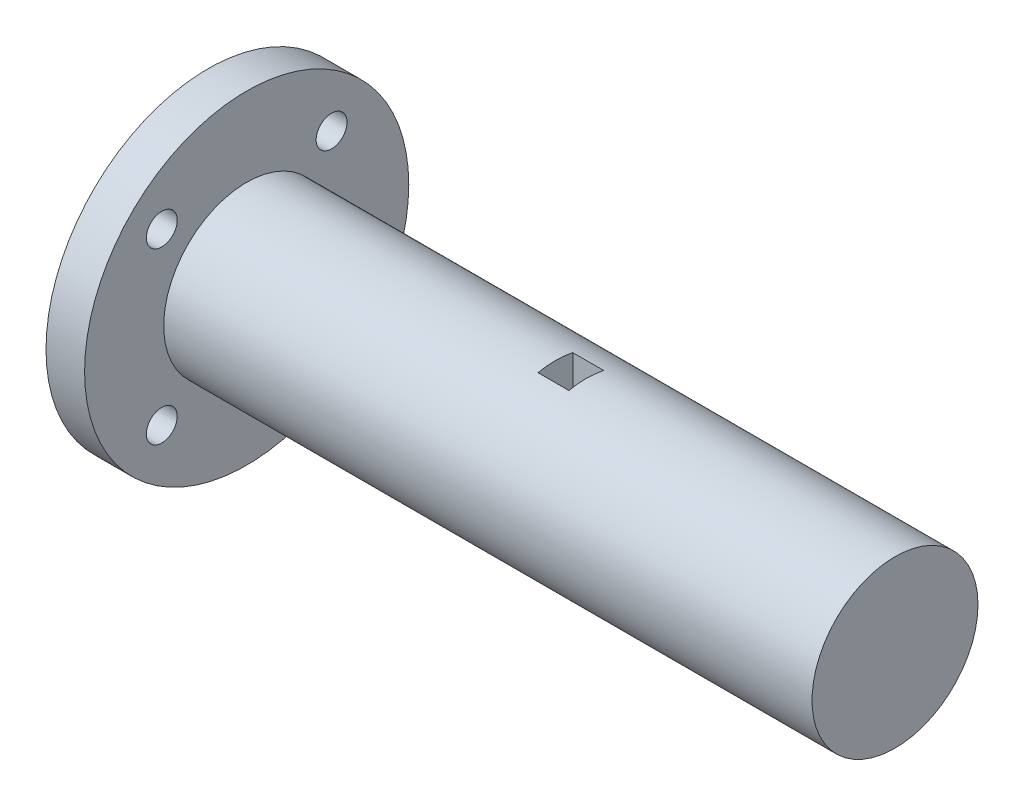
ISO-10303-21;
HEADER;
FILE_DESCRIPTION(('STEP AP214'),'2;1');
FILE_NAME('part.step','',(''),(''),'','','');
FILE_SCHEMA(('AUTOMOTIVE_DESIGN { 1 0 10303 214 1 1 1 1 }'));
ENDSEC;
DATA;
#1=APPLICATION_CONTEXT('core data for automotive mechanical design processes');
#2=APPLICATION_PROTOCOL_DEFINITION('international standard','automotive_design',2000,#1);
#3=PRODUCT_CONTEXT('',#1,'mechanical');
#4=PRODUCT('Part','Part','',(#3));
#5=PRODUCT_RELATED_PRODUCT_CATEGORY('part','',(#4));
#6=PRODUCT_DEFINITION_FORMATION('','',#4);
#7=PRODUCT_DEFINITION_CONTEXT('part definition',#1,'design');
#8=PRODUCT_DEFINITION('design','',#6,#7);
#9=PRODUCT_DEFINITION_SHAPE('','',#8);
#10=(LENGTH_UNIT() NAMED_UNIT(*) SI_UNIT(.MILLI.,.METRE.));
#11=(NAMED_UNIT(*) PLANE_ANGLE_UNIT() SI_UNIT($,.RADIAN.));
#12=(NAMED_UNIT(*) SI_UNIT($,.STERADIAN.) SOLID_ANGLE_UNIT());
#13=UNCERTAINTY_MEASURE_WITH_UNIT(LENGTH_MEASURE(1.E-05),#10,'distance_accuracy_value','');
#14=(GEOMETRIC_REPRESENTATION_CONTEXT(3) GLOBAL_UNCERTAINTY_ASSIGNED_CONTEXT((#13)) GLOBAL_UNIT_ASSIGNED_CONTEXT((#10,
#11,#12)) REPRESENTATION_CONTEXT('',''));
#15=CARTESIAN_POINT('',(0.,0.,0.));
#16=DIRECTION('',(0.,0.,1.));
#17=DIRECTION('',(1.,0.,0.));
#18=AXIS2_PLACEMENT_3D('',#15,#16,#17);
#19=CARTESIAN_POINT('',(40.,0.,0.));
#20=DIRECTION('',(-1.,0.,0.));
#21=DIRECTION('',(0.,0.,1.));
#22=AXIS2_PLACEMENT_3D('',#19,#20,#21);
#23=CYLINDRICAL_SURFACE('',#22,10.75);
#24=CARTESIAN_POINT('',(40.,0.,0.));
#25=DIRECTION('',(1.,0.,0.));
#26=DIRECTION('',(0.,0.,-1.));
#27=AXIS2_PLACEMENT_3D('',#24,#25,#26);
#28=CIRCLE('',#27,10.75);
#29=CARTESIAN_POINT('',(40.,10.5118980208143,-2.25));
#30=VERTEX_POINT('',#29);
#31=CARTESIAN_POINT('',(40.,10.5118980208143,2.25));
#32=VERTEX_POINT('',#31);
#33=EDGE_CURVE('E11',#30,#32,#28,.T.);
#34=ORIENTED_EDGE('',*,*,#33,.F.);
#35=DIRECTION('',(-1.,0.,0.));
#36=VECTOR('',#35,1.);
#37=CARTESIAN_POINT('',(44.,10.5118980208143,-2.25));
#38=LINE('',#37,#36);
#39=CARTESIAN_POINT('',(44.,10.5118980208143,-2.25));
#40=VERTEX_POINT('',#39);
#41=EDGE_CURVE('E101',#40,#30,#38,.T.);
#42=ORIENTED_EDGE('',*,*,#41,.F.);
#43=CARTESIAN_POINT('',(44.,0.,0.));
#44=DIRECTION('',(1.,0.,0.));
#45=DIRECTION('',(0.,0.,-1.));
#46=AXIS2_PLACEMENT_3D('',#43,#44,#45);
#47=CIRCLE('',#46,10.75);
#48=CARTESIAN_POINT('',(44.,10.5118980208143,2.25));
#49=VERTEX_POINT('',#48);
#50=EDGE_CURVE('E179',#40,#49,#47,.T.);
#51=ORIENTED_EDGE('',*,*,#50,.T.);
#52=DIRECTION('',(-1.,0.,0.));
#53=VECTOR('',#52,1.);
#54=CARTESIAN_POINT('',(44.,10.5118980208143,2.25));
#55=LINE('',#54,#53);
#56=EDGE_CURVE('E73',#49,#32,#55,.T.);
#57=ORIENTED_EDGE('',*,*,#56,.T.);
#58=EDGE_LOOP('',(#34,#42,#51,#57));
#59=FACE_BOUND('',#58,.T.);
#60=CARTESIAN_POINT('',(0.,0.,0.));
#61=DIRECTION('',(1.,0.,0.));
#62=DIRECTION('',(0.,0.,-1.));
#63=AXIS2_PLACEMENT_3D('',#60,#61,#62);
#64=CIRCLE('',#63,10.75);
#65=CARTESIAN_POINT('',(0.,0.,-10.75));
#66=VERTEX_POINT('',#65);
#67=EDGE_CURVE('E35',#66,#66,#64,.T.);
#68=ORIENTED_EDGE('',*,*,#67,.T.);
#69=EDGE_LOOP('',(#68));
#70=FACE_BOUND('',#69,.T.);
#71=CARTESIAN_POINT('',(84.,0.,0.));
#72=DIRECTION('',(1.,0.,0.));
#73=DIRECTION('',(0.,0.,-1.));
#74=AXIS2_PLACEMENT_3D('',#71,#72,#73);
#75=CIRCLE('',#74,10.75);
#76=CARTESIAN_POINT('',(84.,0.,-10.75));
#77=VERTEX_POINT('',#76);
#78=EDGE_CURVE('E96',#77,#77,#75,.T.);
#79=ORIENTED_EDGE('',*,*,#78,.F.);
#80=EDGE_LOOP('',(#79));
#81=FACE_BOUND('',#80,.T.);
#82=ADVANCED_FACE('F32',(#59,#70,#81),#23,.T.);
#83=CARTESIAN_POINT('',(40.,0.,0.));
#84=DIRECTION('',(1.,0.,0.));
#85=DIRECTION('',(0.,0.,-1.));
#86=AXIS2_PLACEMENT_3D('',#83,#84,#85);
#87=PLANE('',#86);
#88=DIRECTION('',(0.,1.,0.));
#89=VECTOR('',#88,1.);
#90=CARTESIAN_POINT('',(40.,6.51189802081432,2.25));
#91=LINE('',#90,#89);
#92=CARTESIAN_POINT('',(40.,6.51189802081432,2.25));
#93=VERTEX_POINT('',#92);
#94=EDGE_CURVE('E45',#93,#32,#91,.T.);
#95=ORIENTED_EDGE('',*,*,#94,.F.);
#96=DIRECTION('',(0.,0.,1.));
#97=VECTOR('',#96,1.);
#98=CARTESIAN_POINT('',(40.,6.51189802081432,2.25));
#99=LINE('',#98,#97);
#100=CARTESIAN_POINT('',(40.,6.51189802081432,-2.25));
#101=VERTEX_POINT('',#100);
#102=EDGE_CURVE('E79',#101,#93,#99,.T.);
#103=ORIENTED_EDGE('',*,*,#102,.F.);
#104=DIRECTION('',(0.,-1.,0.));
#105=VECTOR('',#104,1.);
#106=CARTESIAN_POINT('',(40.,6.51189802081432,-2.25));
#107=LINE('',#106,#105);
#108=EDGE_CURVE('E95',#30,#101,#107,.T.);
#109=ORIENTED_EDGE('',*,*,#108,.F.);
#110=ORIENTED_EDGE('',*,*,#33,.T.);
#111=EDGE_LOOP('',(#95,#103,#109,#110));
#112=FACE_BOUND('',#111,.T.);
#113=ADVANCED_FACE('F167',(#112),#87,.T.);
#114=CARTESIAN_POINT('',(-5.,0.,0.));
#115=DIRECTION('',(-1.,0.,0.));
#116=DIRECTION('',(0.,0.,1.));
#117=AXIS2_PLACEMENT_3D('',#114,#115,#116);
#118=PLANE('',#117);
#119=CARTESIAN_POINT('',(-5.,-11.,11.));
#120=DIRECTION('',(-1.,0.,0.));
#121=DIRECTION('',(0.,0.,1.));
#122=AXIS2_PLACEMENT_3D('',#119,#120,#121);
#123=CIRCLE('',#122,2.);
#124=CARTESIAN_POINT('',(-5.,-11.,13.));
#125=VERTEX_POINT('',#124);
#126=EDGE_CURVE('E112',#125,#125,#123,.T.);
#127=ORIENTED_EDGE('',*,*,#126,.F.);
#128=EDGE_LOOP('',(#127));
#129=FACE_BOUND('',#128,.T.);
#130=CARTESIAN_POINT('',(-5.,11.,-11.));
#131=DIRECTION('',(-1.,0.,0.));
#132=DIRECTION('',(0.,0.,1.));
#133=AXIS2_PLACEMENT_3D('',#130,#131,#132);
#134=CIRCLE('',#133,2.);
#135=CARTESIAN_POINT('',(-5.,11.,-9.));
#136=VERTEX_POINT('',#135);
#137=EDGE_CURVE('E124',#136,#136,#134,.T.);
#138=ORIENTED_EDGE('',*,*,#137,.F.);
#139=EDGE_LOOP('',(#138));
#140=FACE_BOUND('',#139,.T.);
#141=CARTESIAN_POINT('',(-5.,0.,0.));
#142=DIRECTION('',(-1.,0.,0.));
#143=DIRECTION('',(0.,0.,1.));
#144=AXIS2_PLACEMENT_3D('',#141,#142,#143);
#145=CIRCLE('',#144,21.);
#146=CARTESIAN_POINT('',(-5.,0.,21.));
#147=VERTEX_POINT('',#146);
#148=EDGE_CURVE('E130',#147,#147,#145,.T.);
#149=ORIENTED_EDGE('',*,*,#148,.T.);
#150=EDGE_LOOP('',(#149));
#151=FACE_BOUND('',#150,.T.);
#152=CARTESIAN_POINT('',(-5.,11.,11.));
#153=DIRECTION('',(-1.,0.,0.));
#154=DIRECTION('',(0.,0.,-1.));
#155=AXIS2_PLACEMENT_3D('',#152,#153,#154);
#156=CIRCLE('',#155,2.);
#157=CARTESIAN_POINT('',(-5.,11.,9.));
#158=VERTEX_POINT('',#157);
#159=EDGE_CURVE('E118',#158,#158,#156,.T.);
#160=ORIENTED_EDGE('',*,*,#159,.F.);
#161=EDGE_LOOP('',(#160));
#162=FACE_BOUND('',#161,.T.);
#163=CARTESIAN_POINT('',(-5.,-11.,-11.));
#164=DIRECTION('',(-1.,0.,0.));
#165=DIRECTION('',(0.,0.,-1.));
#166=AXIS2_PLACEMENT_3D('',#163,#164,#165);
#167=CIRCLE('',#166,2.);
#168=CARTESIAN_POINT('',(-5.,-11.,-13.));
#169=VERTEX_POINT('',#168);
#170=EDGE_CURVE('E106',#169,#169,#167,.T.);
#171=ORIENTED_EDGE('',*,*,#170,.F.);
#172=EDGE_LOOP('',(#171));
#173=FACE_BOUND('',#172,.T.);
#174=ADVANCED_FACE('F141',(#129,#140,#151,#162,#173),#118,.T.);
#175=CARTESIAN_POINT('',(0.,0.,0.));
#176=DIRECTION('',(-1.,0.,0.));
#177=DIRECTION('',(0.,0.,1.));
#178=AXIS2_PLACEMENT_3D('',#175,#176,#177);
#179=PLANE('',#178);
#180=ORIENTED_EDGE('',*,*,#67,.F.);
#181=EDGE_LOOP('',(#180));
#182=FACE_BOUND('',#181,.T.);
#183=CARTESIAN_POINT('',(0.,0.,0.));
#184=DIRECTION('',(-1.,0.,0.));
#185=DIRECTION('',(0.,0.,1.));
#186=AXIS2_PLACEMENT_3D('',#183,#184,#185);
#187=CIRCLE('',#186,21.);
#188=CARTESIAN_POINT('',(0.,0.,21.));
#189=VERTEX_POINT('',#188);
#190=EDGE_CURVE('E127',#189,#189,#187,.T.);
#191=ORIENTED_EDGE('',*,*,#190,.F.);
#192=EDGE_LOOP('',(#191));
#193=FACE_BOUND('',#192,.T.);
#194=CARTESIAN_POINT('',(0.,11.,-11.));
#195=DIRECTION('',(-1.,0.,0.));
#196=DIRECTION('',(0.,0.,1.));
#197=AXIS2_PLACEMENT_3D('',#194,#195,#196);
#198=CIRCLE('',#197,2.);
#199=CARTESIAN_POINT('',(0.,11.,-9.));
#200=VERTEX_POINT('',#199);
#201=EDGE_CURVE('E121',#200,#200,#198,.T.);
#202=ORIENTED_EDGE('',*,*,#201,.T.);
#203=EDGE_LOOP('',(#202));
#204=FACE_BOUND('',#203,.T.);
#205=CARTESIAN_POINT('',(0.,11.,11.));
#206=DIRECTION('',(-1.,0.,0.));
#207=DIRECTION('',(0.,0.,-1.));
#208=AXIS2_PLACEMENT_3D('',#205,#206,#207);
#209=CIRCLE('',#208,2.);
#210=CARTESIAN_POINT('',(0.,11.,9.));
#211=VERTEX_POINT('',#210);
#212=EDGE_CURVE('E115',#211,#211,#209,.T.);
#213=ORIENTED_EDGE('',*,*,#212,.T.);
#214=EDGE_LOOP('',(#213));
#215=FACE_BOUND('',#214,.T.);
#216=CARTESIAN_POINT('',(0.,-11.,11.));
#217=DIRECTION('',(-1.,0.,0.));
#218=DIRECTION('',(0.,0.,1.));
#219=AXIS2_PLACEMENT_3D('',#216,#217,#218);
#220=CIRCLE('',#219,2.);
#221=CARTESIAN_POINT('',(0.,-11.,13.));
#222=VERTEX_POINT('',#221);
#223=EDGE_CURVE('E109',#222,#222,#220,.T.);
#224=ORIENTED_EDGE('',*,*,#223,.T.);
#225=EDGE_LOOP('',(#224));
#226=FACE_BOUND('',#225,.T.);
#227=CARTESIAN_POINT('',(0.,-11.,-11.));
#228=DIRECTION('',(-1.,0.,0.));
#229=DIRECTION('',(0.,0.,-1.));
#230=AXIS2_PLACEMENT_3D('',#227,#228,#229);
#231=CIRCLE('',#230,2.);
#232=CARTESIAN_POINT('',(0.,-11.,-13.));
#233=VERTEX_POINT('',#232);
#234=EDGE_CURVE('E105',#233,#233,#231,.T.);
#235=ORIENTED_EDGE('',*,*,#234,.T.);
#236=EDGE_LOOP('',(#235));
#237=FACE_BOUND('',#236,.T.);
#238=ADVANCED_FACE('F138',(#182,#193,#204,#215,#226,#237),#179,.F.);
#239=CARTESIAN_POINT('',(-5.,0.,0.));
#240=DIRECTION('',(1.,0.,0.));
#241=DIRECTION('',(0.,0.,-1.));
#242=AXIS2_PLACEMENT_3D('',#239,#240,#241);
#243=CYLINDRICAL_SURFACE('',#242,21.);
#244=ORIENTED_EDGE('',*,*,#148,.F.);
#245=EDGE_LOOP('',(#244));
#246=FACE_BOUND('',#245,.T.);
#247=ORIENTED_EDGE('',*,*,#190,.T.);
#248=EDGE_LOOP('',(#247));
#249=FACE_BOUND('',#248,.T.);
#250=ADVANCED_FACE('F136',(#246,#249),#243,.T.);
#251=CARTESIAN_POINT('',(-5.,11.,-11.));
#252=DIRECTION('',(1.,0.,0.));
#253=DIRECTION('',(0.,0.,-1.));
#254=AXIS2_PLACEMENT_3D('',#251,#252,#253);
#255=CYLINDRICAL_SURFACE('',#254,2.);
#256=ORIENTED_EDGE('',*,*,#137,.T.);
#257=EDGE_LOOP('',(#256));
#258=FACE_BOUND('',#257,.T.);
#259=ORIENTED_EDGE('',*,*,#201,.F.);
#260=EDGE_LOOP('',(#259));
#261=FACE_BOUND('',#260,.T.);
#262=ADVANCED_FACE('F247',(#258,#261),#255,.F.);
#263=CARTESIAN_POINT('',(-5.,11.,11.));
#264=DIRECTION('',(1.,0.,0.));
#265=DIRECTION('',(0.,0.,-1.));
#266=AXIS2_PLACEMENT_3D('',#263,#264,#265);
#267=CYLINDRICAL_SURFACE('',#266,2.);
#268=ORIENTED_EDGE('',*,*,#159,.T.);
#269=EDGE_LOOP('',(#268));
#270=FACE_BOUND('',#269,.T.);
#271=ORIENTED_EDGE('',*,*,#212,.F.);
#272=EDGE_LOOP('',(#271));
#273=FACE_BOUND('',#272,.T.);
#274=ADVANCED_FACE('F163',(#270,#273),#267,.F.);
#275=CARTESIAN_POINT('',(-5.,-11.,11.));
#276=DIRECTION('',(1.,0.,0.));
#277=DIRECTION('',(0.,0.,-1.));
#278=AXIS2_PLACEMENT_3D('',#275,#276,#277);
#279=CYLINDRICAL_SURFACE('',#278,2.);
#280=ORIENTED_EDGE('',*,*,#126,.T.);
#281=EDGE_LOOP('',(#280));
#282=FACE_BOUND('',#281,.T.);
#283=ORIENTED_EDGE('',*,*,#223,.F.);
#284=EDGE_LOOP('',(#283));
#285=FACE_BOUND('',#284,.T.);
#286=ADVANCED_FACE('F154',(#282,#285),#279,.F.);
#287=CARTESIAN_POINT('',(-5.,-11.,-11.));
#288=DIRECTION('',(1.,0.,0.));
#289=DIRECTION('',(0.,0.,-1.));
#290=AXIS2_PLACEMENT_3D('',#287,#288,#289);
#291=CYLINDRICAL_SURFACE('',#290,2.);
#292=ORIENTED_EDGE('',*,*,#170,.T.);
#293=EDGE_LOOP('',(#292));
#294=FACE_BOUND('',#293,.T.);
#295=ORIENTED_EDGE('',*,*,#234,.F.);
#296=EDGE_LOOP('',(#295));
#297=FACE_BOUND('',#296,.T.);
#298=ADVANCED_FACE('F152',(#294,#297),#291,.F.);
#299=CARTESIAN_POINT('',(44.,6.51189802081432,2.25));
#300=DIRECTION('',(0.,0.,1.));
#301=DIRECTION('',(0.,-1.,0.));
#302=AXIS2_PLACEMENT_3D('',#299,#300,#301);
#303=PLANE('',#302);
#304=ORIENTED_EDGE('',*,*,#94,.T.);
#305=ORIENTED_EDGE('',*,*,#56,.F.);
#306=DIRECTION('',(0.,1.,0.));
#307=VECTOR('',#306,1.);
#308=CARTESIAN_POINT('',(44.,6.51189802081432,2.25));
#309=LINE('',#308,#307);
#310=CARTESIAN_POINT('',(44.,6.51189802081432,2.25));
#311=VERTEX_POINT('',#310);
#312=EDGE_CURVE('E69',#311,#49,#309,.T.);
#313=ORIENTED_EDGE('',*,*,#312,.F.);
#314=DIRECTION('',(-1.,0.,0.));
#315=VECTOR('',#314,1.);
#316=CARTESIAN_POINT('',(44.,6.51189802081432,2.25));
#317=LINE('',#316,#315);
#318=EDGE_CURVE('E72',#311,#93,#317,.T.);
#319=ORIENTED_EDGE('',*,*,#318,.T.);
#320=EDGE_LOOP('',(#304,#305,#313,#319));
#321=FACE_BOUND('',#320,.T.);
#322=ADVANCED_FACE('F71',(#321),#303,.F.);
#323=CARTESIAN_POINT('',(44.,6.51189802081432,-2.25));
#324=DIRECTION('',(0.,0.,-1.));
#325=DIRECTION('',(0.,1.,0.));
#326=AXIS2_PLACEMENT_3D('',#323,#324,#325);
#327=PLANE('',#326);
#328=ORIENTED_EDGE('',*,*,#108,.T.);
#329=DIRECTION('',(-1.,0.,0.));
#330=VECTOR('',#329,1.);
#331=CARTESIAN_POINT('',(44.,6.51189802081432,-2.25));
#332=LINE('',#331,#330);
#333=CARTESIAN_POINT('',(44.,6.51189802081432,-2.25));
#334=VERTEX_POINT('',#333);
#335=EDGE_CURVE('E87',#334,#101,#332,.T.);
#336=ORIENTED_EDGE('',*,*,#335,.F.);
#337=DIRECTION('',(0.,-1.,0.));
#338=VECTOR('',#337,1.);
#339=CARTESIAN_POINT('',(44.,6.51189802081432,-2.25));
#340=LINE('',#339,#338);
#341=EDGE_CURVE('E78',#40,#334,#340,.T.);
#342=ORIENTED_EDGE('',*,*,#341,.F.);
#343=ORIENTED_EDGE('',*,*,#41,.T.);
#344=EDGE_LOOP('',(#328,#336,#342,#343));
#345=FACE_BOUND('',#344,.T.);
#346=ADVANCED_FACE('F161',(#345),#327,.F.);
#347=CARTESIAN_POINT('',(44.,6.51189802081432,2.25));
#348=DIRECTION('',(0.,-1.,0.));
#349=DIRECTION('',(0.,0.,-1.));
#350=AXIS2_PLACEMENT_3D('',#347,#348,#349);
#351=PLANE('',#350);
#352=ORIENTED_EDGE('',*,*,#102,.T.);
#353=ORIENTED_EDGE('',*,*,#318,.F.);
#354=DIRECTION('',(0.,0.,1.));
#355=VECTOR('',#354,1.);
#356=CARTESIAN_POINT('',(44.,6.51189802081432,2.25));
#357=LINE('',#356,#355);
#358=EDGE_CURVE('E85',#334,#311,#357,.T.);
#359=ORIENTED_EDGE('',*,*,#358,.F.);
#360=ORIENTED_EDGE('',*,*,#335,.T.);
#361=EDGE_LOOP('',(#352,#353,#359,#360));
#362=FACE_BOUND('',#361,.T.);
#363=ADVANCED_FACE('F83',(#362),#351,.F.);
#364=CARTESIAN_POINT('',(44.,0.,0.));
#365=DIRECTION('',(1.,0.,0.));
#366=DIRECTION('',(0.,0.,-1.));
#367=AXIS2_PLACEMENT_3D('',#364,#365,#366);
#368=PLANE('',#367);
#369=ORIENTED_EDGE('',*,*,#358,.T.);
#370=ORIENTED_EDGE('',*,*,#312,.T.);
#371=ORIENTED_EDGE('',*,*,#50,.F.);
#372=ORIENTED_EDGE('',*,*,#341,.T.);
#373=EDGE_LOOP('',(#369,#370,#371,#372));
#374=FACE_BOUND('',#373,.T.);
#375=ADVANCED_FACE('F89',(#374),#368,.F.);
#376=CARTESIAN_POINT('',(84.,0.,0.));
#377=DIRECTION('',(1.,0.,0.));
#378=DIRECTION('',(0.,0.,-1.));
#379=AXIS2_PLACEMENT_3D('',#376,#377,#378);
#380=PLANE('',#379);
#381=ORIENTED_EDGE('',*,*,#78,.T.);
#382=EDGE_LOOP('',(#381));
#383=FACE_BOUND('',#382,.T.);
#384=ADVANCED_FACE('F192',(#383),#380,.T.);
#385=CLOSED_SHELL('',(#82,#113,#174,#238,#250,#262,#274,#286,#298,#322,#346,#363,#375,#384));
#386=MANIFOLD_SOLID_BREP('B2',#385);
#387=ADVANCED_BREP_SHAPE_REPRESENTATION('',(#18,#386),#14);
#388=SHAPE_DEFINITION_REPRESENTATION(#9,#387);
ENDSEC;
END-ISO-10303-21;
